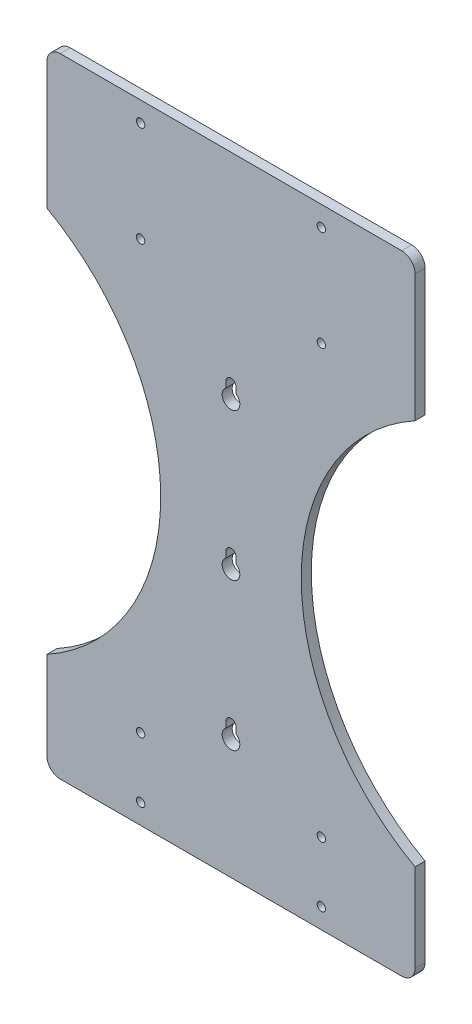
ISO-10303-21;
HEADER;
FILE_DESCRIPTION(('STEP AP214'),'2;1');
FILE_NAME('part.step','',(''),(''),'','','');
FILE_SCHEMA(('AUTOMOTIVE_DESIGN { 1 0 10303 214 1 1 1 1 }'));
ENDSEC;
DATA;
#1=APPLICATION_CONTEXT('core data for automotive mechanical design processes');
#2=APPLICATION_PROTOCOL_DEFINITION('international standard','automotive_design',2000,#1);
#3=PRODUCT_CONTEXT('',#1,'mechanical');
#4=PRODUCT('Part','Part','',(#3));
#5=PRODUCT_RELATED_PRODUCT_CATEGORY('part','',(#4));
#6=PRODUCT_DEFINITION_FORMATION('','',#4);
#7=PRODUCT_DEFINITION_CONTEXT('part definition',#1,'design');
#8=PRODUCT_DEFINITION('design','',#6,#7);
#9=PRODUCT_DEFINITION_SHAPE('','',#8);
#10=(LENGTH_UNIT() NAMED_UNIT(*) SI_UNIT(.MILLI.,.METRE.));
#11=(NAMED_UNIT(*) PLANE_ANGLE_UNIT() SI_UNIT($,.RADIAN.));
#12=(NAMED_UNIT(*) SI_UNIT($,.STERADIAN.) SOLID_ANGLE_UNIT());
#13=UNCERTAINTY_MEASURE_WITH_UNIT(LENGTH_MEASURE(1.E-05),#10,'distance_accuracy_value','');
#14=(GEOMETRIC_REPRESENTATION_CONTEXT(3) GLOBAL_UNCERTAINTY_ASSIGNED_CONTEXT((#13)) GLOBAL_UNIT_ASSIGNED_CONTEXT((#10,
#11,#12)) REPRESENTATION_CONTEXT('',''));
#15=CARTESIAN_POINT('',(0.,0.,0.));
#16=DIRECTION('',(0.,0.,1.));
#17=DIRECTION('',(1.,0.,0.));
#18=AXIS2_PLACEMENT_3D('',#15,#16,#17);
#19=CARTESIAN_POINT('',(-276.225,-31.7500000000001,0.));
#20=DIRECTION('',(0.,0.,1.));
#21=DIRECTION('',(1.,0.,0.));
#22=AXIS2_PLACEMENT_3D('',#19,#20,#21);
#23=PLANE('',#22);
#24=CARTESIAN_POINT('',(85.7249999999999,265.938,0.));
#25=DIRECTION('',(0.,0.,-1.));
#26=DIRECTION('',(-1.,0.,0.));
#27=AXIS2_PLACEMENT_3D('',#24,#25,#26);
#28=CIRCLE('',#27,3.96874999999999);
#29=CARTESIAN_POINT('',(81.75625,265.938,0.));
#30=VERTEX_POINT('',#29);
#31=EDGE_CURVE('E604',#30,#30,#28,.T.);
#32=ORIENTED_EDGE('',*,*,#31,.F.);
#33=EDGE_LOOP('',(#32));
#34=FACE_BOUND('',#33,.T.);
#35=CARTESIAN_POINT('',(-85.725,170.688,0.));
#36=DIRECTION('',(0.,0.,-1.));
#37=DIRECTION('',(-1.,0.,0.));
#38=AXIS2_PLACEMENT_3D('',#35,#36,#37);
#39=CIRCLE('',#38,3.96874999999999);
#40=CARTESIAN_POINT('',(-89.69375,170.688,0.));
#41=VERTEX_POINT('',#40);
#42=EDGE_CURVE('E612',#41,#41,#39,.T.);
#43=ORIENTED_EDGE('',*,*,#42,.F.);
#44=EDGE_LOOP('',(#43));
#45=FACE_BOUND('',#44,.T.);
#46=CARTESIAN_POINT('',(-85.7249999999999,265.938,0.));
#47=DIRECTION('',(0.,0.,-1.));
#48=DIRECTION('',(-1.,0.,0.));
#49=AXIS2_PLACEMENT_3D('',#46,#47,#48);
#50=CIRCLE('',#49,3.96874999999999);
#51=CARTESIAN_POINT('',(-89.6937499999999,265.938,0.));
#52=VERTEX_POINT('',#51);
#53=EDGE_CURVE('E618',#52,#52,#50,.T.);
#54=ORIENTED_EDGE('',*,*,#53,.F.);
#55=EDGE_LOOP('',(#54));
#56=FACE_BOUND('',#55,.T.);
#57=CARTESIAN_POINT('',(85.7249999999999,170.688,0.));
#58=DIRECTION('',(0.,0.,-1.));
#59=DIRECTION('',(-1.,0.,0.));
#60=AXIS2_PLACEMENT_3D('',#57,#58,#59);
#61=CIRCLE('',#60,3.96874999999999);
#62=CARTESIAN_POINT('',(81.75625,170.688,0.));
#63=VERTEX_POINT('',#62);
#64=EDGE_CURVE('E624',#63,#63,#61,.T.);
#65=ORIENTED_EDGE('',*,*,#64,.F.);
#66=EDGE_LOOP('',(#65));
#67=FACE_BOUND('',#66,.T.);
#68=CARTESIAN_POINT('',(-85.725,-234.95,0.));
#69=DIRECTION('',(0.,0.,-1.));
#70=DIRECTION('',(-1.,0.,0.));
#71=AXIS2_PLACEMENT_3D('',#68,#69,#70);
#72=CIRCLE('',#71,3.96874999999999);
#73=CARTESIAN_POINT('',(-89.69375,-234.95,0.));
#74=VERTEX_POINT('',#73);
#75=EDGE_CURVE('E630',#74,#74,#72,.T.);
#76=ORIENTED_EDGE('',*,*,#75,.F.);
#77=EDGE_LOOP('',(#76));
#78=FACE_BOUND('',#77,.T.);
#79=CARTESIAN_POINT('',(-85.725,-292.1,0.));
#80=DIRECTION('',(0.,0.,-1.));
#81=DIRECTION('',(-1.,0.,0.));
#82=AXIS2_PLACEMENT_3D('',#79,#80,#81);
#83=CIRCLE('',#82,3.96874999999999);
#84=CARTESIAN_POINT('',(-89.69375,-292.1,0.));
#85=VERTEX_POINT('',#84);
#86=EDGE_CURVE('E636',#85,#85,#83,.T.);
#87=ORIENTED_EDGE('',*,*,#86,.F.);
#88=EDGE_LOOP('',(#87));
#89=FACE_BOUND('',#88,.T.);
#90=CARTESIAN_POINT('',(85.7249999999999,-292.1,0.));
#91=DIRECTION('',(0.,0.,-1.));
#92=DIRECTION('',(-1.,0.,0.));
#93=AXIS2_PLACEMENT_3D('',#90,#91,#92);
#94=CIRCLE('',#93,3.96874999999999);
#95=CARTESIAN_POINT('',(81.7562499999999,-292.1,0.));
#96=VERTEX_POINT('',#95);
#97=EDGE_CURVE('E642',#96,#96,#94,.T.);
#98=ORIENTED_EDGE('',*,*,#97,.F.);
#99=EDGE_LOOP('',(#98));
#100=FACE_BOUND('',#99,.T.);
#101=CARTESIAN_POINT('',(85.7249999999999,-234.95,0.));
#102=DIRECTION('',(0.,0.,-1.));
#103=DIRECTION('',(-1.,0.,0.));
#104=AXIS2_PLACEMENT_3D('',#101,#102,#103);
#105=CIRCLE('',#104,3.96874999999999);
#106=CARTESIAN_POINT('',(81.7562499999999,-234.95,0.));
#107=VERTEX_POINT('',#106);
#108=EDGE_CURVE('E648',#107,#107,#105,.T.);
#109=ORIENTED_EDGE('',*,*,#108,.F.);
#110=EDGE_LOOP('',(#109));
#111=FACE_BOUND('',#110,.T.);
#112=DIRECTION('',(0.,-1.,0.));
#113=VECTOR('',#112,1.);
#114=CARTESIAN_POINT('',(-174.625,151.522045058705,0.));
#115=LINE('',#114,#113);
#116=CARTESIAN_POINT('',(-174.625,272.172045058705,0.));
#117=VERTEX_POINT('',#116);
#118=CARTESIAN_POINT('',(-174.625,151.522045058705,0.));
#119=VERTEX_POINT('',#118);
#120=EDGE_CURVE('E521',#117,#119,#115,.T.);
#121=ORIENTED_EDGE('',*,*,#120,.F.);
#122=CARTESIAN_POINT('',(-161.925,272.172045058705,0.));
#123=DIRECTION('',(0.,0.,1.));
#124=DIRECTION('',(1.,0.,0.));
#125=AXIS2_PLACEMENT_3D('',#122,#123,#124);
#126=CIRCLE('',#125,12.7);
#127=CARTESIAN_POINT('',(-161.925,284.872045058705,0.));
#128=VERTEX_POINT('',#127);
#129=EDGE_CURVE('E576',#117,#128,#126,.F.);
#130=ORIENTED_EDGE('',*,*,#129,.T.);
#131=DIRECTION('',(-1.,0.,0.));
#132=VECTOR('',#131,1.);
#133=CARTESIAN_POINT('',(174.625,284.872045058705,0.));
#134=LINE('',#133,#132);
#135=CARTESIAN_POINT('',(161.925,284.872045058705,0.));
#136=VERTEX_POINT('',#135);
#137=EDGE_CURVE('E599',#136,#128,#134,.T.);
#138=ORIENTED_EDGE('',*,*,#137,.F.);
#139=CARTESIAN_POINT('',(161.925,272.172045058705,0.));
#140=DIRECTION('',(0.,0.,1.));
#141=DIRECTION('',(1.,0.,0.));
#142=AXIS2_PLACEMENT_3D('',#139,#140,#141);
#143=CIRCLE('',#142,12.7);
#144=CARTESIAN_POINT('',(174.625,272.172045058705,0.));
#145=VERTEX_POINT('',#144);
#146=EDGE_CURVE('E574',#136,#145,#143,.F.);
#147=ORIENTED_EDGE('',*,*,#146,.T.);
#148=DIRECTION('',(0.,1.,0.));
#149=VECTOR('',#148,1.);
#150=CARTESIAN_POINT('',(174.625,151.522045058705,0.));
#151=LINE('',#150,#149);
#152=CARTESIAN_POINT('',(174.625,151.522045058705,0.));
#153=VERTEX_POINT('',#152);
#154=EDGE_CURVE('E501',#153,#145,#151,.T.);
#155=ORIENTED_EDGE('',*,*,#154,.F.);
#156=CARTESIAN_POINT('',(276.225,-31.7500000000001,0.));
#157=DIRECTION('',(0.,0.,-1.));
#158=DIRECTION('',(-1.,0.,0.));
#159=AXIS2_PLACEMENT_3D('',#156,#157,#158);
#160=CIRCLE('',#159,209.55);
#161=CARTESIAN_POINT('',(174.625,-215.022045058705,0.));
#162=VERTEX_POINT('',#161);
#163=EDGE_CURVE('E505',#162,#153,#160,.T.);
#164=ORIENTED_EDGE('',*,*,#163,.F.);
#165=DIRECTION('',(0.,1.,0.));
#166=VECTOR('',#165,1.);
#167=CARTESIAN_POINT('',(174.625,-311.15,0.));
#168=LINE('',#167,#166);
#169=CARTESIAN_POINT('',(174.625,-298.45,0.));
#170=VERTEX_POINT('',#169);
#171=EDGE_CURVE('E531',#170,#162,#168,.T.);
#172=ORIENTED_EDGE('',*,*,#171,.F.);
#173=CARTESIAN_POINT('',(161.925,-298.45,0.));
#174=DIRECTION('',(0.,0.,1.));
#175=DIRECTION('',(1.,0.,0.));
#176=AXIS2_PLACEMENT_3D('',#173,#174,#175);
#177=CIRCLE('',#176,12.7);
#178=CARTESIAN_POINT('',(161.925,-311.15,0.));
#179=VERTEX_POINT('',#178);
#180=EDGE_CURVE('E550',#170,#179,#177,.F.);
#181=ORIENTED_EDGE('',*,*,#180,.T.);
#182=DIRECTION('',(1.,0.,0.));
#183=VECTOR('',#182,1.);
#184=CARTESIAN_POINT('',(-174.625,-311.15,0.));
#185=LINE('',#184,#183);
#186=CARTESIAN_POINT('',(-161.925,-311.15,0.));
#187=VERTEX_POINT('',#186);
#188=EDGE_CURVE('E528',#187,#179,#185,.T.);
#189=ORIENTED_EDGE('',*,*,#188,.F.);
#190=CARTESIAN_POINT('',(-161.925,-298.45,0.));
#191=DIRECTION('',(0.,0.,1.));
#192=DIRECTION('',(1.,0.,0.));
#193=AXIS2_PLACEMENT_3D('',#190,#191,#192);
#194=CIRCLE('',#193,12.7);
#195=CARTESIAN_POINT('',(-174.625,-298.45,0.));
#196=VERTEX_POINT('',#195);
#197=EDGE_CURVE('E548',#187,#196,#194,.F.);
#198=ORIENTED_EDGE('',*,*,#197,.T.);
#199=DIRECTION('',(0.,-1.,0.));
#200=VECTOR('',#199,1.);
#201=CARTESIAN_POINT('',(-174.625,-311.15,0.));
#202=LINE('',#201,#200);
#203=CARTESIAN_POINT('',(-174.625,-215.022045058705,0.));
#204=VERTEX_POINT('',#203);
#205=EDGE_CURVE('E525',#204,#196,#202,.T.);
#206=ORIENTED_EDGE('',*,*,#205,.F.);
#207=CARTESIAN_POINT('',(-276.225,-31.7500000000001,0.));
#208=DIRECTION('',(0.,0.,-1.));
#209=DIRECTION('',(1.,0.,0.));
#210=AXIS2_PLACEMENT_3D('',#207,#208,#209);
#211=CIRCLE('',#210,209.55);
#212=EDGE_CURVE('E523',#119,#204,#211,.T.);
#213=ORIENTED_EDGE('',*,*,#212,.F.);
#214=EDGE_LOOP('',(#121,#130,#138,#147,#155,#164,#172,#181,#189,#198,#206,#213));
#215=FACE_BOUND('',#214,.T.);
#216=DIRECTION('',(0.,1.,0.));
#217=VECTOR('',#216,1.);
#218=CARTESIAN_POINT('',(-4.78789999999995,-57.8866000000001,0.));
#219=LINE('',#218,#217);
#220=CARTESIAN_POINT('',(-4.78789999999995,-51.0066336054601,0.));
#221=VERTEX_POINT('',#220);
#222=CARTESIAN_POINT('',(-4.78789999999995,-45.2374000000001,0.));
#223=VERTEX_POINT('',#222);
#224=EDGE_CURVE('E485',#221,#223,#219,.T.);
#225=ORIENTED_EDGE('',*,*,#224,.F.);
#226=CARTESIAN_POINT('',(0.,-57.8866000000001,0.));
#227=DIRECTION('',(0.,0.,1.));
#228=DIRECTION('',(1.,0.,0.));
#229=AXIS2_PLACEMENT_3D('',#226,#227,#228);
#230=CIRCLE('',#229,8.382);
#231=CARTESIAN_POINT('',(4.78790000000004,-51.0066336054601,0.));
#232=VERTEX_POINT('',#231);
#233=EDGE_CURVE('E660',#221,#232,#230,.T.);
#234=ORIENTED_EDGE('',*,*,#233,.T.);
#235=DIRECTION('',(0.,1.,0.));
#236=VECTOR('',#235,1.);
#237=CARTESIAN_POINT('',(4.78790000000004,-57.8866000000001,0.));
#238=LINE('',#237,#236);
#239=CARTESIAN_POINT('',(4.78790000000004,-45.2374000000001,0.));
#240=VERTEX_POINT('',#239);
#241=EDGE_CURVE('E483',#232,#240,#238,.T.);
#242=ORIENTED_EDGE('',*,*,#241,.T.);
#243=CARTESIAN_POINT('',(0.,-45.2374000000001,0.));
#244=DIRECTION('',(0.,0.,1.));
#245=DIRECTION('',(1.,0.,0.));
#246=AXIS2_PLACEMENT_3D('',#243,#244,#245);
#247=CIRCLE('',#246,4.7879);
#248=EDGE_CURVE('E495',#240,#223,#247,.T.);
#249=ORIENTED_EDGE('',*,*,#248,.T.);
#250=EDGE_LOOP('',(#225,#234,#242,#249));
#251=FACE_BOUND('',#250,.T.);
#252=DIRECTION('',(0.,1.,0.));
#253=VECTOR('',#252,1.);
#254=CARTESIAN_POINT('',(-4.78789999999997,81.8133999999999,0.));
#255=LINE('',#254,#253);
#256=CARTESIAN_POINT('',(-4.78789999999997,88.6933663945399,0.));
#257=VERTEX_POINT('',#256);
#258=CARTESIAN_POINT('',(-4.78789999999997,94.4625999999999,0.));
#259=VERTEX_POINT('',#258);
#260=EDGE_CURVE('E465',#257,#259,#255,.T.);
#261=ORIENTED_EDGE('',*,*,#260,.F.);
#262=CARTESIAN_POINT('',(0.,81.8133999999999,0.));
#263=DIRECTION('',(0.,0.,1.));
#264=DIRECTION('',(1.,0.,0.));
#265=AXIS2_PLACEMENT_3D('',#262,#263,#264);
#266=CIRCLE('',#265,8.382);
#267=CARTESIAN_POINT('',(4.78790000000003,88.6933663945399,0.));
#268=VERTEX_POINT('',#267);
#269=EDGE_CURVE('E440',#257,#268,#266,.T.);
#270=ORIENTED_EDGE('',*,*,#269,.T.);
#271=DIRECTION('',(0.,1.,0.));
#272=VECTOR('',#271,1.);
#273=CARTESIAN_POINT('',(4.78790000000003,81.8133999999999,0.));
#274=LINE('',#273,#272);
#275=CARTESIAN_POINT('',(4.78790000000002,94.4625999999999,0.));
#276=VERTEX_POINT('',#275);
#277=EDGE_CURVE('E463',#268,#276,#274,.T.);
#278=ORIENTED_EDGE('',*,*,#277,.T.);
#279=CARTESIAN_POINT('',(0.,94.4625999999999,0.));
#280=DIRECTION('',(0.,0.,1.));
#281=DIRECTION('',(1.,0.,0.));
#282=AXIS2_PLACEMENT_3D('',#279,#280,#281);
#283=CIRCLE('',#282,4.7879);
#284=EDGE_CURVE('E475',#276,#259,#283,.T.);
#285=ORIENTED_EDGE('',*,*,#284,.T.);
#286=EDGE_LOOP('',(#261,#270,#278,#285));
#287=FACE_BOUND('',#286,.T.);
#288=DIRECTION('',(0.,1.,0.));
#289=VECTOR('',#288,1.);
#290=CARTESIAN_POINT('',(-4.78789999999993,-197.5866,0.));
#291=LINE('',#290,#289);
#292=CARTESIAN_POINT('',(-4.78789999999994,-190.70663360546,0.));
#293=VERTEX_POINT('',#292);
#294=CARTESIAN_POINT('',(-4.78789999999994,-184.9374,0.));
#295=VERTEX_POINT('',#294);
#296=EDGE_CURVE('E447',#293,#295,#291,.T.);
#297=ORIENTED_EDGE('',*,*,#296,.F.);
#298=CARTESIAN_POINT('',(0.,-197.5866,0.));
#299=DIRECTION('',(0.,0.,1.));
#300=DIRECTION('',(1.,0.,0.));
#301=AXIS2_PLACEMENT_3D('',#298,#299,#300);
#302=CIRCLE('',#301,8.38200000000001);
#303=CARTESIAN_POINT('',(4.78790000000006,-190.70663360546,0.));
#304=VERTEX_POINT('',#303);
#305=EDGE_CURVE('E426',#293,#304,#302,.T.);
#306=ORIENTED_EDGE('',*,*,#305,.T.);
#307=DIRECTION('',(0.,1.,0.));
#308=VECTOR('',#307,1.);
#309=CARTESIAN_POINT('',(4.78790000000006,-197.5866,0.));
#310=LINE('',#309,#308);
#311=CARTESIAN_POINT('',(4.78790000000004,-184.9374,0.));
#312=VERTEX_POINT('',#311);
#313=EDGE_CURVE('E452',#304,#312,#310,.T.);
#314=ORIENTED_EDGE('',*,*,#313,.T.);
#315=CARTESIAN_POINT('',(0.,-184.9374,0.));
#316=DIRECTION('',(0.,0.,1.));
#317=DIRECTION('',(1.,0.,0.));
#318=AXIS2_PLACEMENT_3D('',#315,#316,#317);
#319=CIRCLE('',#318,4.7879);
#320=EDGE_CURVE('E457',#312,#295,#319,.T.);
#321=ORIENTED_EDGE('',*,*,#320,.T.);
#322=EDGE_LOOP('',(#297,#306,#314,#321));
#323=FACE_BOUND('',#322,.T.);
#324=ADVANCED_FACE('F258',(#34,#45,#56,#67,#78,#89,#100,#111,#215,#251,#287,#323),#23,.F.);
#325=CARTESIAN_POINT('',(174.625,151.522045058705,9.525));
#326=DIRECTION('',(-1.,0.,0.));
#327=DIRECTION('',(0.,0.,1.));
#328=AXIS2_PLACEMENT_3D('',#325,#326,#327);
#329=PLANE('',#328);
#330=ORIENTED_EDGE('',*,*,#154,.T.);
#331=DIRECTION('',(0.,0.,-1.));
#332=VECTOR('',#331,1.);
#333=CARTESIAN_POINT('',(174.625,272.172045058705,9.525));
#334=LINE('',#333,#332);
#335=CARTESIAN_POINT('',(174.625,272.172045058705,9.525));
#336=VERTEX_POINT('',#335);
#337=EDGE_CURVE('E13',#145,#336,#334,.F.);
#338=ORIENTED_EDGE('',*,*,#337,.T.);
#339=DIRECTION('',(0.,1.,0.));
#340=VECTOR('',#339,1.);
#341=CARTESIAN_POINT('',(174.625,151.522045058705,9.525));
#342=LINE('',#341,#340);
#343=CARTESIAN_POINT('',(174.625,151.522045058705,9.525));
#344=VERTEX_POINT('',#343);
#345=EDGE_CURVE('E502',#344,#336,#342,.T.);
#346=ORIENTED_EDGE('',*,*,#345,.F.);
#347=DIRECTION('',(0.,0.,-1.));
#348=VECTOR('',#347,1.);
#349=CARTESIAN_POINT('',(174.625,151.522045058705,9.525));
#350=LINE('',#349,#348);
#351=EDGE_CURVE('E519',#344,#153,#350,.T.);
#352=ORIENTED_EDGE('',*,*,#351,.T.);
#353=EDGE_LOOP('',(#330,#338,#346,#352));
#354=FACE_BOUND('',#353,.T.);
#355=ADVANCED_FACE('F689',(#354),#329,.F.);
#356=CARTESIAN_POINT('',(-174.625,151.522045058705,9.525));
#357=DIRECTION('',(1.,0.,0.));
#358=DIRECTION('',(0.,0.,-1.));
#359=AXIS2_PLACEMENT_3D('',#356,#357,#358);
#360=PLANE('',#359);
#361=DIRECTION('',(0.,-1.,0.));
#362=VECTOR('',#361,1.);
#363=CARTESIAN_POINT('',(-174.625,151.522045058705,9.525));
#364=LINE('',#363,#362);
#365=CARTESIAN_POINT('',(-174.625,272.172045058705,9.525));
#366=VERTEX_POINT('',#365);
#367=CARTESIAN_POINT('',(-174.625,151.522045058705,9.525));
#368=VERTEX_POINT('',#367);
#369=EDGE_CURVE('E504',#366,#368,#364,.T.);
#370=ORIENTED_EDGE('',*,*,#369,.F.);
#371=DIRECTION('',(0.,0.,-1.));
#372=VECTOR('',#371,1.);
#373=CARTESIAN_POINT('',(-174.625,272.172045058705,9.525));
#374=LINE('',#373,#372);
#375=EDGE_CURVE('E571',#366,#117,#374,.T.);
#376=ORIENTED_EDGE('',*,*,#375,.T.);
#377=ORIENTED_EDGE('',*,*,#120,.T.);
#378=DIRECTION('',(0.,0.,-1.));
#379=VECTOR('',#378,1.);
#380=CARTESIAN_POINT('',(-174.625,151.522045058705,9.525));
#381=LINE('',#380,#379);
#382=EDGE_CURVE('E542',#368,#119,#381,.T.);
#383=ORIENTED_EDGE('',*,*,#382,.F.);
#384=EDGE_LOOP('',(#370,#376,#377,#383));
#385=FACE_BOUND('',#384,.T.);
#386=ADVANCED_FACE('F592',(#385),#360,.F.);
#387=CARTESIAN_POINT('',(-276.225,-31.7500000000001,9.525));
#388=DIRECTION('',(0.,0.,-1.));
#389=DIRECTION('',(-1.,0.,0.));
#390=AXIS2_PLACEMENT_3D('',#387,#388,#389);
#391=CYLINDRICAL_SURFACE('',#390,209.55);
#392=ORIENTED_EDGE('',*,*,#212,.T.);
#393=DIRECTION('',(0.,0.,-1.));
#394=VECTOR('',#393,1.);
#395=CARTESIAN_POINT('',(-174.625,-215.022045058705,9.525));
#396=LINE('',#395,#394);
#397=CARTESIAN_POINT('',(-174.625,-215.022045058705,9.525));
#398=VERTEX_POINT('',#397);
#399=EDGE_CURVE('E539',#398,#204,#396,.T.);
#400=ORIENTED_EDGE('',*,*,#399,.F.);
#401=CARTESIAN_POINT('',(-276.225,-31.7500000000001,9.525));
#402=DIRECTION('',(0.,0.,-1.));
#403=DIRECTION('',(1.,0.,0.));
#404=AXIS2_PLACEMENT_3D('',#401,#402,#403);
#405=CIRCLE('',#404,209.55);
#406=EDGE_CURVE('E507',#368,#398,#405,.T.);
#407=ORIENTED_EDGE('',*,*,#406,.F.);
#408=ORIENTED_EDGE('',*,*,#382,.T.);
#409=EDGE_LOOP('',(#392,#400,#407,#408));
#410=FACE_BOUND('',#409,.T.);
#411=ADVANCED_FACE('F716',(#410),#391,.F.);
#412=CARTESIAN_POINT('',(-174.625,-311.15,9.525));
#413=DIRECTION('',(1.,0.,0.));
#414=DIRECTION('',(0.,0.,-1.));
#415=AXIS2_PLACEMENT_3D('',#412,#413,#414);
#416=PLANE('',#415);
#417=ORIENTED_EDGE('',*,*,#205,.T.);
#418=DIRECTION('',(0.,0.,-1.));
#419=VECTOR('',#418,1.);
#420=CARTESIAN_POINT('',(-174.625,-298.45,9.525));
#421=LINE('',#420,#419);
#422=CARTESIAN_POINT('',(-174.625,-298.45,9.525));
#423=VERTEX_POINT('',#422);
#424=EDGE_CURVE('E561',#196,#423,#421,.F.);
#425=ORIENTED_EDGE('',*,*,#424,.T.);
#426=DIRECTION('',(0.,-1.,0.));
#427=VECTOR('',#426,1.);
#428=CARTESIAN_POINT('',(-174.625,-311.15,9.525));
#429=LINE('',#428,#427);
#430=EDGE_CURVE('E509',#398,#423,#429,.T.);
#431=ORIENTED_EDGE('',*,*,#430,.F.);
#432=ORIENTED_EDGE('',*,*,#399,.T.);
#433=EDGE_LOOP('',(#417,#425,#431,#432));
#434=FACE_BOUND('',#433,.T.);
#435=ADVANCED_FACE('F712',(#434),#416,.F.);
#436=CARTESIAN_POINT('',(-174.625,-311.15,9.525));
#437=DIRECTION('',(0.,1.,0.));
#438=DIRECTION('',(0.,0.,1.));
#439=AXIS2_PLACEMENT_3D('',#436,#437,#438);
#440=PLANE('',#439);
#441=ORIENTED_EDGE('',*,*,#188,.T.);
#442=DIRECTION('',(0.,0.,-1.));
#443=VECTOR('',#442,1.);
#444=CARTESIAN_POINT('',(161.925,-311.15,9.525));
#445=LINE('',#444,#443);
#446=CARTESIAN_POINT('',(161.925,-311.15,9.525));
#447=VERTEX_POINT('',#446);
#448=EDGE_CURVE('E555',#179,#447,#445,.F.);
#449=ORIENTED_EDGE('',*,*,#448,.T.);
#450=DIRECTION('',(1.,0.,0.));
#451=VECTOR('',#450,1.);
#452=CARTESIAN_POINT('',(-174.625,-311.15,9.525));
#453=LINE('',#452,#451);
#454=CARTESIAN_POINT('',(-161.925,-311.15,9.525));
#455=VERTEX_POINT('',#454);
#456=EDGE_CURVE('E512',#455,#447,#453,.T.);
#457=ORIENTED_EDGE('',*,*,#456,.F.);
#458=DIRECTION('',(0.,0.,-1.));
#459=VECTOR('',#458,1.);
#460=CARTESIAN_POINT('',(-161.925,-311.15,9.525));
#461=LINE('',#460,#459);
#462=EDGE_CURVE('E552',#455,#187,#461,.T.);
#463=ORIENTED_EDGE('',*,*,#462,.T.);
#464=EDGE_LOOP('',(#441,#449,#457,#463));
#465=FACE_BOUND('',#464,.T.);
#466=ADVANCED_FACE('F708',(#465),#440,.F.);
#467=CARTESIAN_POINT('',(174.625,-311.15,9.525));
#468=DIRECTION('',(-1.,0.,0.));
#469=DIRECTION('',(0.,0.,1.));
#470=AXIS2_PLACEMENT_3D('',#467,#468,#469);
#471=PLANE('',#470);
#472=DIRECTION('',(0.,1.,0.));
#473=VECTOR('',#472,1.);
#474=CARTESIAN_POINT('',(174.625,-311.15,9.525));
#475=LINE('',#474,#473);
#476=CARTESIAN_POINT('',(174.625,-298.45,9.525));
#477=VERTEX_POINT('',#476);
#478=CARTESIAN_POINT('',(174.625,-215.022045058705,9.525));
#479=VERTEX_POINT('',#478);
#480=EDGE_CURVE('E515',#477,#479,#475,.T.);
#481=ORIENTED_EDGE('',*,*,#480,.F.);
#482=DIRECTION('',(0.,0.,-1.));
#483=VECTOR('',#482,1.);
#484=CARTESIAN_POINT('',(174.625,-298.45,9.525));
#485=LINE('',#484,#483);
#486=EDGE_CURVE('E545',#477,#170,#485,.T.);
#487=ORIENTED_EDGE('',*,*,#486,.T.);
#488=ORIENTED_EDGE('',*,*,#171,.T.);
#489=DIRECTION('',(0.,0.,-1.));
#490=VECTOR('',#489,1.);
#491=CARTESIAN_POINT('',(174.625,-215.022045058705,9.525));
#492=LINE('',#491,#490);
#493=EDGE_CURVE('E536',#479,#162,#492,.T.);
#494=ORIENTED_EDGE('',*,*,#493,.F.);
#495=EDGE_LOOP('',(#481,#487,#488,#494));
#496=FACE_BOUND('',#495,.T.);
#497=ADVANCED_FACE('F704',(#496),#471,.F.);
#498=CARTESIAN_POINT('',(276.225,-31.7500000000001,9.525));
#499=DIRECTION('',(0.,0.,-1.));
#500=DIRECTION('',(-1.,0.,0.));
#501=AXIS2_PLACEMENT_3D('',#498,#499,#500);
#502=CYLINDRICAL_SURFACE('',#501,209.55);
#503=ORIENTED_EDGE('',*,*,#163,.T.);
#504=ORIENTED_EDGE('',*,*,#351,.F.);
#505=CARTESIAN_POINT('',(276.225,-31.7500000000001,9.525));
#506=DIRECTION('',(0.,0.,-1.));
#507=DIRECTION('',(-1.,0.,0.));
#508=AXIS2_PLACEMENT_3D('',#505,#506,#507);
#509=CIRCLE('',#508,209.55);
#510=EDGE_CURVE('E517',#479,#344,#509,.T.);
#511=ORIENTED_EDGE('',*,*,#510,.F.);
#512=ORIENTED_EDGE('',*,*,#493,.T.);
#513=EDGE_LOOP('',(#503,#504,#511,#512));
#514=FACE_BOUND('',#513,.T.);
#515=ADVANCED_FACE('F701',(#514),#502,.F.);
#516=CARTESIAN_POINT('',(-276.225,-31.7500000000001,9.525));
#517=DIRECTION('',(0.,0.,1.));
#518=DIRECTION('',(1.,0.,0.));
#519=AXIS2_PLACEMENT_3D('',#516,#517,#518);
#520=PLANE('',#519);
#521=DIRECTION('',(-1.,0.,0.));
#522=VECTOR('',#521,1.);
#523=CARTESIAN_POINT('',(174.625,284.872045058705,9.525));
#524=LINE('',#523,#522);
#525=CARTESIAN_POINT('',(161.925,284.872045058705,9.525));
#526=VERTEX_POINT('',#525);
#527=CARTESIAN_POINT('',(-161.925,284.872045058705,9.525));
#528=VERTEX_POINT('',#527);
#529=EDGE_CURVE('E588',#526,#528,#524,.T.);
#530=ORIENTED_EDGE('',*,*,#529,.T.);
#531=CARTESIAN_POINT('',(-161.925,272.172045058705,9.525));
#532=DIRECTION('',(0.,0.,1.));
#533=DIRECTION('',(1.,0.,0.));
#534=AXIS2_PLACEMENT_3D('',#531,#532,#533);
#535=CIRCLE('',#534,12.7);
#536=EDGE_CURVE('E266',#528,#366,#535,.T.);
#537=ORIENTED_EDGE('',*,*,#536,.T.);
#538=ORIENTED_EDGE('',*,*,#369,.T.);
#539=ORIENTED_EDGE('',*,*,#406,.T.);
#540=ORIENTED_EDGE('',*,*,#430,.T.);
#541=CARTESIAN_POINT('',(-161.925,-298.45,9.525));
#542=DIRECTION('',(0.,0.,1.));
#543=DIRECTION('',(1.,0.,0.));
#544=AXIS2_PLACEMENT_3D('',#541,#542,#543);
#545=CIRCLE('',#544,12.7);
#546=EDGE_CURVE('E557',#423,#455,#545,.T.);
#547=ORIENTED_EDGE('',*,*,#546,.T.);
#548=ORIENTED_EDGE('',*,*,#456,.T.);
#549=CARTESIAN_POINT('',(161.925,-298.45,9.525));
#550=DIRECTION('',(0.,0.,1.));
#551=DIRECTION('',(1.,0.,0.));
#552=AXIS2_PLACEMENT_3D('',#549,#550,#551);
#553=CIRCLE('',#552,12.7);
#554=EDGE_CURVE('E559',#447,#477,#553,.T.);
#555=ORIENTED_EDGE('',*,*,#554,.T.);
#556=ORIENTED_EDGE('',*,*,#480,.T.);
#557=ORIENTED_EDGE('',*,*,#510,.T.);
#558=ORIENTED_EDGE('',*,*,#345,.T.);
#559=CARTESIAN_POINT('',(161.925,272.172045058705,9.525));
#560=DIRECTION('',(0.,0.,1.));
#561=DIRECTION('',(1.,0.,0.));
#562=AXIS2_PLACEMENT_3D('',#559,#560,#561);
#563=CIRCLE('',#562,12.7);
#564=EDGE_CURVE('E582',#336,#526,#563,.T.);
#565=ORIENTED_EDGE('',*,*,#564,.T.);
#566=EDGE_LOOP('',(#530,#537,#538,#539,#540,#547,#548,#555,#556,#557,#558,#565));
#567=FACE_BOUND('',#566,.T.);
#568=CARTESIAN_POINT('',(85.7249999999999,265.938,9.525));
#569=DIRECTION('',(0.,0.,-1.));
#570=DIRECTION('',(-1.,0.,0.));
#571=AXIS2_PLACEMENT_3D('',#568,#569,#570);
#572=CIRCLE('',#571,3.96874999999999);
#573=CARTESIAN_POINT('',(81.75625,265.938,9.525));
#574=VERTEX_POINT('',#573);
#575=EDGE_CURVE('E609',#574,#574,#572,.T.);
#576=ORIENTED_EDGE('',*,*,#575,.T.);
#577=EDGE_LOOP('',(#576));
#578=FACE_BOUND('',#577,.T.);
#579=CARTESIAN_POINT('',(-85.725,170.688,9.525));
#580=DIRECTION('',(0.,0.,-1.));
#581=DIRECTION('',(-1.,0.,0.));
#582=AXIS2_PLACEMENT_3D('',#579,#580,#581);
#583=CIRCLE('',#582,3.96874999999999);
#584=CARTESIAN_POINT('',(-89.69375,170.688,9.525));
#585=VERTEX_POINT('',#584);
#586=EDGE_CURVE('E615',#585,#585,#583,.T.);
#587=ORIENTED_EDGE('',*,*,#586,.T.);
#588=EDGE_LOOP('',(#587));
#589=FACE_BOUND('',#588,.T.);
#590=CARTESIAN_POINT('',(-85.7249999999999,265.938,9.525));
#591=DIRECTION('',(0.,0.,-1.));
#592=DIRECTION('',(-1.,0.,0.));
#593=AXIS2_PLACEMENT_3D('',#590,#591,#592);
#594=CIRCLE('',#593,3.96874999999999);
#595=CARTESIAN_POINT('',(-89.6937499999999,265.938,9.525));
#596=VERTEX_POINT('',#595);
#597=EDGE_CURVE('E621',#596,#596,#594,.T.);
#598=ORIENTED_EDGE('',*,*,#597,.T.);
#599=EDGE_LOOP('',(#598));
#600=FACE_BOUND('',#599,.T.);
#601=CARTESIAN_POINT('',(85.7249999999999,170.688,9.525));
#602=DIRECTION('',(0.,0.,-1.));
#603=DIRECTION('',(-1.,0.,0.));
#604=AXIS2_PLACEMENT_3D('',#601,#602,#603);
#605=CIRCLE('',#604,3.96874999999999);
#606=CARTESIAN_POINT('',(81.75625,170.688,9.525));
#607=VERTEX_POINT('',#606);
#608=EDGE_CURVE('E627',#607,#607,#605,.T.);
#609=ORIENTED_EDGE('',*,*,#608,.T.);
#610=EDGE_LOOP('',(#609));
#611=FACE_BOUND('',#610,.T.);
#612=CARTESIAN_POINT('',(-85.725,-234.95,9.525));
#613=DIRECTION('',(0.,0.,-1.));
#614=DIRECTION('',(-1.,0.,0.));
#615=AXIS2_PLACEMENT_3D('',#612,#613,#614);
#616=CIRCLE('',#615,3.96874999999999);
#617=CARTESIAN_POINT('',(-89.69375,-234.95,9.525));
#618=VERTEX_POINT('',#617);
#619=EDGE_CURVE('E633',#618,#618,#616,.T.);
#620=ORIENTED_EDGE('',*,*,#619,.T.);
#621=EDGE_LOOP('',(#620));
#622=FACE_BOUND('',#621,.T.);
#623=CARTESIAN_POINT('',(-85.725,-292.1,9.525));
#624=DIRECTION('',(0.,0.,-1.));
#625=DIRECTION('',(-1.,0.,0.));
#626=AXIS2_PLACEMENT_3D('',#623,#624,#625);
#627=CIRCLE('',#626,3.96874999999999);
#628=CARTESIAN_POINT('',(-89.69375,-292.1,9.525));
#629=VERTEX_POINT('',#628);
#630=EDGE_CURVE('E639',#629,#629,#627,.T.);
#631=ORIENTED_EDGE('',*,*,#630,.T.);
#632=EDGE_LOOP('',(#631));
#633=FACE_BOUND('',#632,.T.);
#634=CARTESIAN_POINT('',(85.7249999999999,-292.1,9.525));
#635=DIRECTION('',(0.,0.,-1.));
#636=DIRECTION('',(-1.,0.,0.));
#637=AXIS2_PLACEMENT_3D('',#634,#635,#636);
#638=CIRCLE('',#637,3.96874999999999);
#639=CARTESIAN_POINT('',(81.7562499999999,-292.1,9.525));
#640=VERTEX_POINT('',#639);
#641=EDGE_CURVE('E645',#640,#640,#638,.T.);
#642=ORIENTED_EDGE('',*,*,#641,.T.);
#643=EDGE_LOOP('',(#642));
#644=FACE_BOUND('',#643,.T.);
#645=CARTESIAN_POINT('',(85.7249999999999,-234.95,9.525));
#646=DIRECTION('',(0.,0.,-1.));
#647=DIRECTION('',(-1.,0.,0.));
#648=AXIS2_PLACEMENT_3D('',#645,#646,#647);
#649=CIRCLE('',#648,3.96874999999999);
#650=CARTESIAN_POINT('',(81.7562499999999,-234.95,9.525));
#651=VERTEX_POINT('',#650);
#652=EDGE_CURVE('E651',#651,#651,#649,.T.);
#653=ORIENTED_EDGE('',*,*,#652,.T.);
#654=EDGE_LOOP('',(#653));
#655=FACE_BOUND('',#654,.T.);
#656=CARTESIAN_POINT('',(0.,-197.5866,9.525));
#657=DIRECTION('',(0.,0.,1.));
#658=DIRECTION('',(1.,0.,0.));
#659=AXIS2_PLACEMENT_3D('',#656,#657,#658);
#660=CIRCLE('',#659,8.38200000000001);
#661=CARTESIAN_POINT('',(-4.78789999999994,-190.70663360546,9.525));
#662=VERTEX_POINT('',#661);
#663=CARTESIAN_POINT('',(4.78790000000012,-190.70663360546,9.525));
#664=VERTEX_POINT('',#663);
#665=EDGE_CURVE('E423',#662,#664,#660,.T.);
#666=ORIENTED_EDGE('',*,*,#665,.F.);
#667=DIRECTION('',(0.,1.,0.));
#668=VECTOR('',#667,1.);
#669=CARTESIAN_POINT('',(-4.78789999999993,-197.5866,9.525));
#670=LINE('',#669,#668);
#671=CARTESIAN_POINT('',(-4.78789999999994,-184.9374,9.525));
#672=VERTEX_POINT('',#671);
#673=EDGE_CURVE('E437',#662,#672,#670,.T.);
#674=ORIENTED_EDGE('',*,*,#673,.T.);
#675=CARTESIAN_POINT('',(0.,-184.9374,9.525));
#676=DIRECTION('',(0.,0.,1.));
#677=DIRECTION('',(1.,0.,0.));
#678=AXIS2_PLACEMENT_3D('',#675,#676,#677);
#679=CIRCLE('',#678,4.7879);
#680=CARTESIAN_POINT('',(4.78790000000012,-184.9374,9.525));
#681=VERTEX_POINT('',#680);
#682=EDGE_CURVE('E450',#681,#672,#679,.T.);
#683=ORIENTED_EDGE('',*,*,#682,.F.);
#684=DIRECTION('',(0.,1.,0.));
#685=VECTOR('',#684,1.);
#686=CARTESIAN_POINT('',(4.78790000000012,-197.5866,9.525));
#687=LINE('',#686,#685);
#688=EDGE_CURVE('E439',#664,#681,#687,.T.);
#689=ORIENTED_EDGE('',*,*,#688,.F.);
#690=EDGE_LOOP('',(#666,#674,#683,#689));
#691=FACE_BOUND('',#690,.T.);
#692=CARTESIAN_POINT('',(0.,81.8133999999999,9.525));
#693=DIRECTION('',(0.,0.,1.));
#694=DIRECTION('',(1.,0.,0.));
#695=AXIS2_PLACEMENT_3D('',#692,#693,#694);
#696=CIRCLE('',#695,8.382);
#697=CARTESIAN_POINT('',(-4.78789999999997,88.6933663945399,9.525));
#698=VERTEX_POINT('',#697);
#699=CARTESIAN_POINT('',(4.78790000000007,88.6933663945399,9.525));
#700=VERTEX_POINT('',#699);
#701=EDGE_CURVE('E658',#698,#700,#696,.T.);
#702=ORIENTED_EDGE('',*,*,#701,.F.);
#703=DIRECTION('',(0.,1.,0.));
#704=VECTOR('',#703,1.);
#705=CARTESIAN_POINT('',(-4.78789999999997,81.8133999999999,9.525));
#706=LINE('',#705,#704);
#707=CARTESIAN_POINT('',(-4.78789999999997,94.4625999999999,9.525));
#708=VERTEX_POINT('',#707);
#709=EDGE_CURVE('E467',#698,#708,#706,.T.);
#710=ORIENTED_EDGE('',*,*,#709,.T.);
#711=CARTESIAN_POINT('',(0.,94.4625999999999,9.525));
#712=DIRECTION('',(0.,0.,1.));
#713=DIRECTION('',(1.,0.,0.));
#714=AXIS2_PLACEMENT_3D('',#711,#712,#713);
#715=CIRCLE('',#714,4.7879);
#716=CARTESIAN_POINT('',(4.78790000000007,94.4625999999999,9.525));
#717=VERTEX_POINT('',#716);
#718=EDGE_CURVE('E472',#717,#708,#715,.T.);
#719=ORIENTED_EDGE('',*,*,#718,.F.);
#720=DIRECTION('',(0.,1.,0.));
#721=VECTOR('',#720,1.);
#722=CARTESIAN_POINT('',(4.78790000000007,81.8133999999999,9.525));
#723=LINE('',#722,#721);
#724=EDGE_CURVE('E461',#700,#717,#723,.T.);
#725=ORIENTED_EDGE('',*,*,#724,.F.);
#726=EDGE_LOOP('',(#702,#710,#719,#725));
#727=FACE_BOUND('',#726,.T.);
#728=CARTESIAN_POINT('',(0.,-57.8866000000001,9.525));
#729=DIRECTION('',(0.,0.,1.));
#730=DIRECTION('',(1.,0.,0.));
#731=AXIS2_PLACEMENT_3D('',#728,#729,#730);
#732=CIRCLE('',#731,8.382);
#733=CARTESIAN_POINT('',(-4.78789999999995,-51.0066336054601,9.525));
#734=VERTEX_POINT('',#733);
#735=CARTESIAN_POINT('',(4.78790000000001,-51.0066336054601,9.525));
#736=VERTEX_POINT('',#735);
#737=EDGE_CURVE('E654',#734,#736,#732,.T.);
#738=ORIENTED_EDGE('',*,*,#737,.F.);
#739=DIRECTION('',(0.,1.,0.));
#740=VECTOR('',#739,1.);
#741=CARTESIAN_POINT('',(-4.78789999999995,-57.8866000000001,9.525));
#742=LINE('',#741,#740);
#743=CARTESIAN_POINT('',(-4.78789999999995,-45.2374000000001,9.525));
#744=VERTEX_POINT('',#743);
#745=EDGE_CURVE('E487',#734,#744,#742,.T.);
#746=ORIENTED_EDGE('',*,*,#745,.T.);
#747=CARTESIAN_POINT('',(0.,-45.2374000000001,9.525));
#748=DIRECTION('',(0.,0.,1.));
#749=DIRECTION('',(1.,0.,0.));
#750=AXIS2_PLACEMENT_3D('',#747,#748,#749);
#751=CIRCLE('',#750,4.7879);
#752=CARTESIAN_POINT('',(4.78790000000001,-45.2374000000001,9.525));
#753=VERTEX_POINT('',#752);
#754=EDGE_CURVE('E492',#753,#744,#751,.T.);
#755=ORIENTED_EDGE('',*,*,#754,.F.);
#756=DIRECTION('',(0.,1.,0.));
#757=VECTOR('',#756,1.);
#758=CARTESIAN_POINT('',(4.78790000000001,-57.8866000000001,9.525));
#759=LINE('',#758,#757);
#760=EDGE_CURVE('E481',#736,#753,#759,.T.);
#761=ORIENTED_EDGE('',*,*,#760,.F.);
#762=EDGE_LOOP('',(#738,#746,#755,#761));
#763=FACE_BOUND('',#762,.T.);
#764=ADVANCED_FACE('F434',(#567,#578,#589,#600,#611,#622,#633,#644,#655,#691,#727,#763),#520,.T.);
#765=CARTESIAN_POINT('',(0.,-45.2374000000001,9.525));
#766=DIRECTION('',(0.,0.,1.));
#767=DIRECTION('',(1.,0.,0.));
#768=AXIS2_PLACEMENT_3D('',#765,#766,#767);
#769=CYLINDRICAL_SURFACE('',#768,4.7879);
#770=ORIENTED_EDGE('',*,*,#248,.F.);
#771=DIRECTION('',(0.,0.,-1.));
#772=VECTOR('',#771,1.);
#773=CARTESIAN_POINT('',(4.78790000000004,-45.2374000000001,0.));
#774=LINE('',#773,#772);
#775=EDGE_CURVE('E489',#753,#240,#774,.T.);
#776=ORIENTED_EDGE('',*,*,#775,.F.);
#777=ORIENTED_EDGE('',*,*,#754,.T.);
#778=DIRECTION('',(0.,0.,1.));
#779=VECTOR('',#778,1.);
#780=CARTESIAN_POINT('',(-4.78789999999995,-45.2374000000001,9.525));
#781=LINE('',#780,#779);
#782=EDGE_CURVE('E498',#223,#744,#781,.T.);
#783=ORIENTED_EDGE('',*,*,#782,.F.);
#784=EDGE_LOOP('',(#770,#776,#777,#783));
#785=FACE_BOUND('',#784,.T.);
#786=ADVANCED_FACE('F868',(#785),#769,.F.);
#787=CARTESIAN_POINT('',(-4.78789999999995,-57.8866000000001,9.525));
#788=DIRECTION('',(-1.,0.,0.));
#789=DIRECTION('',(0.,-1.,0.));
#790=AXIS2_PLACEMENT_3D('',#787,#788,#789);
#791=PLANE('',#790);
#792=ORIENTED_EDGE('',*,*,#745,.F.);
#793=DIRECTION('',(0.,0.,1.));
#794=VECTOR('',#793,1.);
#795=CARTESIAN_POINT('',(-4.78789999999995,-51.0066336054601,0.));
#796=LINE('',#795,#794);
#797=EDGE_CURVE('E666',#734,#221,#796,.F.);
#798=ORIENTED_EDGE('',*,*,#797,.T.);
#799=ORIENTED_EDGE('',*,*,#224,.T.);
#800=ORIENTED_EDGE('',*,*,#782,.T.);
#801=EDGE_LOOP('',(#792,#798,#799,#800));
#802=FACE_BOUND('',#801,.T.);
#803=ADVANCED_FACE('F892',(#802),#791,.F.);
#804=CARTESIAN_POINT('',(4.78790000000004,-57.8866000000001,0.));
#805=DIRECTION('',(1.,0.,0.));
#806=DIRECTION('',(0.,1.,0.));
#807=AXIS2_PLACEMENT_3D('',#804,#805,#806);
#808=PLANE('',#807);
#809=ORIENTED_EDGE('',*,*,#241,.F.);
#810=DIRECTION('',(0.,0.,1.));
#811=VECTOR('',#810,1.);
#812=CARTESIAN_POINT('',(4.78790000000004,-51.0066336054601,0.));
#813=LINE('',#812,#811);
#814=EDGE_CURVE('E568',#232,#736,#813,.T.);
#815=ORIENTED_EDGE('',*,*,#814,.T.);
#816=ORIENTED_EDGE('',*,*,#760,.T.);
#817=ORIENTED_EDGE('',*,*,#775,.T.);
#818=EDGE_LOOP('',(#809,#815,#816,#817));
#819=FACE_BOUND('',#818,.T.);
#820=ADVANCED_FACE('F898',(#819),#808,.F.);
#821=CARTESIAN_POINT('',(0.,94.4625999999999,9.525));
#822=DIRECTION('',(0.,0.,1.));
#823=DIRECTION('',(1.,0.,0.));
#824=AXIS2_PLACEMENT_3D('',#821,#822,#823);
#825=CYLINDRICAL_SURFACE('',#824,4.7879);
#826=ORIENTED_EDGE('',*,*,#284,.F.);
#827=DIRECTION('',(0.,0.,-1.));
#828=VECTOR('',#827,1.);
#829=CARTESIAN_POINT('',(4.78790000000002,94.4625999999999,0.));
#830=LINE('',#829,#828);
#831=EDGE_CURVE('E469',#717,#276,#830,.T.);
#832=ORIENTED_EDGE('',*,*,#831,.F.);
#833=ORIENTED_EDGE('',*,*,#718,.T.);
#834=DIRECTION('',(0.,0.,1.));
#835=VECTOR('',#834,1.);
#836=CARTESIAN_POINT('',(-4.78789999999997,94.4625999999999,9.525));
#837=LINE('',#836,#835);
#838=EDGE_CURVE('E478',#259,#708,#837,.T.);
#839=ORIENTED_EDGE('',*,*,#838,.F.);
#840=EDGE_LOOP('',(#826,#832,#833,#839));
#841=FACE_BOUND('',#840,.T.);
#842=ADVANCED_FACE('F906',(#841),#825,.F.);
#843=CARTESIAN_POINT('',(-4.78789999999997,81.8133999999999,9.525));
#844=DIRECTION('',(-1.,0.,0.));
#845=DIRECTION('',(0.,-1.,0.));
#846=AXIS2_PLACEMENT_3D('',#843,#844,#845);
#847=PLANE('',#846);
#848=ORIENTED_EDGE('',*,*,#709,.F.);
#849=DIRECTION('',(0.,0.,1.));
#850=VECTOR('',#849,1.);
#851=CARTESIAN_POINT('',(-4.78789999999997,88.6933663945399,0.));
#852=LINE('',#851,#850);
#853=EDGE_CURVE('E430',#698,#257,#852,.F.);
#854=ORIENTED_EDGE('',*,*,#853,.T.);
#855=ORIENTED_EDGE('',*,*,#260,.T.);
#856=ORIENTED_EDGE('',*,*,#838,.T.);
#857=EDGE_LOOP('',(#848,#854,#855,#856));
#858=FACE_BOUND('',#857,.T.);
#859=ADVANCED_FACE('F685',(#858),#847,.F.);
#860=CARTESIAN_POINT('',(4.78790000000003,81.8133999999999,0.));
#861=DIRECTION('',(1.,0.,0.));
#862=DIRECTION('',(0.,1.,0.));
#863=AXIS2_PLACEMENT_3D('',#860,#861,#862);
#864=PLANE('',#863);
#865=ORIENTED_EDGE('',*,*,#277,.F.);
#866=DIRECTION('',(0.,0.,1.));
#867=VECTOR('',#866,1.);
#868=CARTESIAN_POINT('',(4.78790000000002,88.6933663945399,0.));
#869=LINE('',#868,#867);
#870=EDGE_CURVE('E565',#268,#700,#869,.T.);
#871=ORIENTED_EDGE('',*,*,#870,.T.);
#872=ORIENTED_EDGE('',*,*,#724,.T.);
#873=ORIENTED_EDGE('',*,*,#831,.T.);
#874=EDGE_LOOP('',(#865,#871,#872,#873));
#875=FACE_BOUND('',#874,.T.);
#876=ADVANCED_FACE('F678',(#875),#864,.F.);
#877=CARTESIAN_POINT('',(0.,-184.9374,9.525));
#878=DIRECTION('',(0.,0.,1.));
#879=DIRECTION('',(1.,0.,0.));
#880=AXIS2_PLACEMENT_3D('',#877,#878,#879);
#881=CYLINDRICAL_SURFACE('',#880,4.7879);
#882=ORIENTED_EDGE('',*,*,#320,.F.);
#883=DIRECTION('',(0.,0.,-1.));
#884=VECTOR('',#883,1.);
#885=CARTESIAN_POINT('',(4.78790000000006,-184.9374,0.));
#886=LINE('',#885,#884);
#887=EDGE_CURVE('E446',#681,#312,#886,.T.);
#888=ORIENTED_EDGE('',*,*,#887,.F.);
#889=ORIENTED_EDGE('',*,*,#682,.T.);
#890=DIRECTION('',(0.,0.,1.));
#891=VECTOR('',#890,1.);
#892=CARTESIAN_POINT('',(-4.78789999999994,-184.9374,9.525));
#893=LINE('',#892,#891);
#894=EDGE_CURVE('E444',#295,#672,#893,.T.);
#895=ORIENTED_EDGE('',*,*,#894,.F.);
#896=EDGE_LOOP('',(#882,#888,#889,#895));
#897=FACE_BOUND('',#896,.T.);
#898=ADVANCED_FACE('F676',(#897),#881,.F.);
#899=CARTESIAN_POINT('',(-4.78789999999993,-197.5866,9.525));
#900=DIRECTION('',(-1.,0.,0.));
#901=DIRECTION('',(0.,-1.,0.));
#902=AXIS2_PLACEMENT_3D('',#899,#900,#901);
#903=PLANE('',#902);
#904=ORIENTED_EDGE('',*,*,#673,.F.);
#905=DIRECTION('',(0.,0.,1.));
#906=VECTOR('',#905,1.);
#907=CARTESIAN_POINT('',(-4.78789999999993,-190.70663360546,0.));
#908=LINE('',#907,#906);
#909=EDGE_CURVE('E420',#662,#293,#908,.F.);
#910=ORIENTED_EDGE('',*,*,#909,.T.);
#911=ORIENTED_EDGE('',*,*,#296,.T.);
#912=ORIENTED_EDGE('',*,*,#894,.T.);
#913=EDGE_LOOP('',(#904,#910,#911,#912));
#914=FACE_BOUND('',#913,.T.);
#915=ADVANCED_FACE('F442',(#914),#903,.F.);
#916=CARTESIAN_POINT('',(4.78790000000006,-197.5866,0.));
#917=DIRECTION('',(1.,0.,0.));
#918=DIRECTION('',(0.,1.,0.));
#919=AXIS2_PLACEMENT_3D('',#916,#917,#918);
#920=PLANE('',#919);
#921=ORIENTED_EDGE('',*,*,#313,.F.);
#922=DIRECTION('',(0.,0.,1.));
#923=VECTOR('',#922,1.);
#924=CARTESIAN_POINT('',(4.78790000000006,-190.70663360546,0.));
#925=LINE('',#924,#923);
#926=EDGE_CURVE('E563',#304,#664,#925,.T.);
#927=ORIENTED_EDGE('',*,*,#926,.T.);
#928=ORIENTED_EDGE('',*,*,#688,.T.);
#929=ORIENTED_EDGE('',*,*,#887,.T.);
#930=EDGE_LOOP('',(#921,#927,#928,#929));
#931=FACE_BOUND('',#930,.T.);
#932=ADVANCED_FACE('F674',(#931),#920,.F.);
#933=CARTESIAN_POINT('',(161.925,-298.45,9.525));
#934=DIRECTION('',(0.,0.,-1.));
#935=DIRECTION('',(-1.,0.,0.));
#936=AXIS2_PLACEMENT_3D('',#933,#934,#935);
#937=CYLINDRICAL_SURFACE('',#936,12.7);
#938=ORIENTED_EDGE('',*,*,#554,.F.);
#939=ORIENTED_EDGE('',*,*,#448,.F.);
#940=ORIENTED_EDGE('',*,*,#180,.F.);
#941=ORIENTED_EDGE('',*,*,#486,.F.);
#942=EDGE_LOOP('',(#938,#939,#940,#941));
#943=FACE_BOUND('',#942,.T.);
#944=ADVANCED_FACE('F723',(#943),#937,.T.);
#945=CARTESIAN_POINT('',(-161.925,-298.45,9.525));
#946=DIRECTION('',(0.,0.,-1.));
#947=DIRECTION('',(-1.,0.,0.));
#948=AXIS2_PLACEMENT_3D('',#945,#946,#947);
#949=CYLINDRICAL_SURFACE('',#948,12.7);
#950=ORIENTED_EDGE('',*,*,#546,.F.);
#951=ORIENTED_EDGE('',*,*,#424,.F.);
#952=ORIENTED_EDGE('',*,*,#197,.F.);
#953=ORIENTED_EDGE('',*,*,#462,.F.);
#954=EDGE_LOOP('',(#950,#951,#952,#953));
#955=FACE_BOUND('',#954,.T.);
#956=ADVANCED_FACE('F726',(#955),#949,.T.);
#957=CARTESIAN_POINT('',(0.,-197.5866,0.));
#958=DIRECTION('',(0.,0.,1.));
#959=DIRECTION('',(1.,0.,0.));
#960=AXIS2_PLACEMENT_3D('',#957,#958,#959);
#961=CYLINDRICAL_SURFACE('',#960,8.38200000000001);
#962=ORIENTED_EDGE('',*,*,#665,.T.);
#963=ORIENTED_EDGE('',*,*,#926,.F.);
#964=ORIENTED_EDGE('',*,*,#305,.F.);
#965=ORIENTED_EDGE('',*,*,#909,.F.);
#966=EDGE_LOOP('',(#962,#963,#964,#965));
#967=FACE_BOUND('',#966,.T.);
#968=ADVANCED_FACE('F422',(#967),#961,.F.);
#969=CARTESIAN_POINT('',(0.,81.8133999999999,0.));
#970=DIRECTION('',(0.,0.,1.));
#971=DIRECTION('',(1.,0.,0.));
#972=AXIS2_PLACEMENT_3D('',#969,#970,#971);
#973=CYLINDRICAL_SURFACE('',#972,8.382);
#974=ORIENTED_EDGE('',*,*,#701,.T.);
#975=ORIENTED_EDGE('',*,*,#870,.F.);
#976=ORIENTED_EDGE('',*,*,#269,.F.);
#977=ORIENTED_EDGE('',*,*,#853,.F.);
#978=EDGE_LOOP('',(#974,#975,#976,#977));
#979=FACE_BOUND('',#978,.T.);
#980=ADVANCED_FACE('F775',(#979),#973,.F.);
#981=CARTESIAN_POINT('',(0.,-57.8866000000001,0.));
#982=DIRECTION('',(0.,0.,1.));
#983=DIRECTION('',(1.,0.,0.));
#984=AXIS2_PLACEMENT_3D('',#981,#982,#983);
#985=CYLINDRICAL_SURFACE('',#984,8.382);
#986=ORIENTED_EDGE('',*,*,#737,.T.);
#987=ORIENTED_EDGE('',*,*,#814,.F.);
#988=ORIENTED_EDGE('',*,*,#233,.F.);
#989=ORIENTED_EDGE('',*,*,#797,.F.);
#990=EDGE_LOOP('',(#986,#987,#988,#989));
#991=FACE_BOUND('',#990,.T.);
#992=ADVANCED_FACE('F771',(#991),#985,.F.);
#993=CARTESIAN_POINT('',(85.7249999999999,-234.95,0.));
#994=DIRECTION('',(0.,0.,-1.));
#995=DIRECTION('',(-1.,0.,0.));
#996=AXIS2_PLACEMENT_3D('',#993,#994,#995);
#997=CYLINDRICAL_SURFACE('',#996,3.96874999999999);
#998=ORIENTED_EDGE('',*,*,#652,.F.);
#999=EDGE_LOOP('',(#998));
#1000=FACE_BOUND('',#999,.T.);
#1001=ORIENTED_EDGE('',*,*,#108,.T.);
#1002=EDGE_LOOP('',(#1001));
#1003=FACE_BOUND('',#1002,.T.);
#1004=ADVANCED_FACE('F767',(#1000,#1003),#997,.F.);
#1005=CARTESIAN_POINT('',(85.7249999999999,-292.1,0.));
#1006=DIRECTION('',(0.,0.,-1.));
#1007=DIRECTION('',(-1.,0.,0.));
#1008=AXIS2_PLACEMENT_3D('',#1005,#1006,#1007);
#1009=CYLINDRICAL_SURFACE('',#1008,3.96874999999999);
#1010=ORIENTED_EDGE('',*,*,#641,.F.);
#1011=EDGE_LOOP('',(#1010));
#1012=FACE_BOUND('',#1011,.T.);
#1013=ORIENTED_EDGE('',*,*,#97,.T.);
#1014=EDGE_LOOP('',(#1013));
#1015=FACE_BOUND('',#1014,.T.);
#1016=ADVANCED_FACE('F763',(#1012,#1015),#1009,.F.);
#1017=CARTESIAN_POINT('',(-85.725,-292.1,0.));
#1018=DIRECTION('',(0.,0.,-1.));
#1019=DIRECTION('',(-1.,0.,0.));
#1020=AXIS2_PLACEMENT_3D('',#1017,#1018,#1019);
#1021=CYLINDRICAL_SURFACE('',#1020,3.96874999999999);
#1022=ORIENTED_EDGE('',*,*,#630,.F.);
#1023=EDGE_LOOP('',(#1022));
#1024=FACE_BOUND('',#1023,.T.);
#1025=ORIENTED_EDGE('',*,*,#86,.T.);
#1026=EDGE_LOOP('',(#1025));
#1027=FACE_BOUND('',#1026,.T.);
#1028=ADVANCED_FACE('F759',(#1024,#1027),#1021,.F.);
#1029=CARTESIAN_POINT('',(-85.725,-234.95,0.));
#1030=DIRECTION('',(0.,0.,-1.));
#1031=DIRECTION('',(-1.,0.,0.));
#1032=AXIS2_PLACEMENT_3D('',#1029,#1030,#1031);
#1033=CYLINDRICAL_SURFACE('',#1032,3.96874999999999);
#1034=ORIENTED_EDGE('',*,*,#619,.F.);
#1035=EDGE_LOOP('',(#1034));
#1036=FACE_BOUND('',#1035,.T.);
#1037=ORIENTED_EDGE('',*,*,#75,.T.);
#1038=EDGE_LOOP('',(#1037));
#1039=FACE_BOUND('',#1038,.T.);
#1040=ADVANCED_FACE('F755',(#1036,#1039),#1033,.F.);
#1041=CARTESIAN_POINT('',(85.7249999999999,170.688,0.));
#1042=DIRECTION('',(0.,0.,-1.));
#1043=DIRECTION('',(-1.,0.,0.));
#1044=AXIS2_PLACEMENT_3D('',#1041,#1042,#1043);
#1045=CYLINDRICAL_SURFACE('',#1044,3.96874999999999);
#1046=ORIENTED_EDGE('',*,*,#608,.F.);
#1047=EDGE_LOOP('',(#1046));
#1048=FACE_BOUND('',#1047,.T.);
#1049=ORIENTED_EDGE('',*,*,#64,.T.);
#1050=EDGE_LOOP('',(#1049));
#1051=FACE_BOUND('',#1050,.T.);
#1052=ADVANCED_FACE('F751',(#1048,#1051),#1045,.F.);
#1053=CARTESIAN_POINT('',(-85.7249999999999,265.938,0.));
#1054=DIRECTION('',(0.,0.,-1.));
#1055=DIRECTION('',(-1.,0.,0.));
#1056=AXIS2_PLACEMENT_3D('',#1053,#1054,#1055);
#1057=CYLINDRICAL_SURFACE('',#1056,3.96874999999999);
#1058=ORIENTED_EDGE('',*,*,#597,.F.);
#1059=EDGE_LOOP('',(#1058));
#1060=FACE_BOUND('',#1059,.T.);
#1061=ORIENTED_EDGE('',*,*,#53,.T.);
#1062=EDGE_LOOP('',(#1061));
#1063=FACE_BOUND('',#1062,.T.);
#1064=ADVANCED_FACE('F747',(#1060,#1063),#1057,.F.);
#1065=CARTESIAN_POINT('',(-85.725,170.688,0.));
#1066=DIRECTION('',(0.,0.,-1.));
#1067=DIRECTION('',(-1.,0.,0.));
#1068=AXIS2_PLACEMENT_3D('',#1065,#1066,#1067);
#1069=CYLINDRICAL_SURFACE('',#1068,3.96874999999999);
#1070=ORIENTED_EDGE('',*,*,#586,.F.);
#1071=EDGE_LOOP('',(#1070));
#1072=FACE_BOUND('',#1071,.T.);
#1073=ORIENTED_EDGE('',*,*,#42,.T.);
#1074=EDGE_LOOP('',(#1073));
#1075=FACE_BOUND('',#1074,.T.);
#1076=ADVANCED_FACE('F741',(#1072,#1075),#1069,.F.);
#1077=CARTESIAN_POINT('',(85.7249999999999,265.938,0.));
#1078=DIRECTION('',(0.,0.,-1.));
#1079=DIRECTION('',(-1.,0.,0.));
#1080=AXIS2_PLACEMENT_3D('',#1077,#1078,#1079);
#1081=CYLINDRICAL_SURFACE('',#1080,3.96874999999999);
#1082=ORIENTED_EDGE('',*,*,#575,.F.);
#1083=EDGE_LOOP('',(#1082));
#1084=FACE_BOUND('',#1083,.T.);
#1085=ORIENTED_EDGE('',*,*,#31,.T.);
#1086=EDGE_LOOP('',(#1085));
#1087=FACE_BOUND('',#1086,.T.);
#1088=ADVANCED_FACE('F736',(#1084,#1087),#1081,.F.);
#1089=CARTESIAN_POINT('',(174.625,284.872045058705,9.525));
#1090=DIRECTION('',(0.,-1.,0.));
#1091=DIRECTION('',(0.,0.,-1.));
#1092=AXIS2_PLACEMENT_3D('',#1089,#1090,#1091);
#1093=PLANE('',#1092);
#1094=ORIENTED_EDGE('',*,*,#137,.T.);
#1095=DIRECTION('',(0.,0.,-1.));
#1096=VECTOR('',#1095,1.);
#1097=CARTESIAN_POINT('',(-161.925,284.872045058705,9.525));
#1098=LINE('',#1097,#1096);
#1099=EDGE_CURVE('E279',#128,#528,#1098,.F.);
#1100=ORIENTED_EDGE('',*,*,#1099,.T.);
#1101=ORIENTED_EDGE('',*,*,#529,.F.);
#1102=DIRECTION('',(0.,0.,-1.));
#1103=VECTOR('',#1102,1.);
#1104=CARTESIAN_POINT('',(161.925,284.872045058705,9.525));
#1105=LINE('',#1104,#1103);
#1106=EDGE_CURVE('E578',#526,#136,#1105,.T.);
#1107=ORIENTED_EDGE('',*,*,#1106,.T.);
#1108=EDGE_LOOP('',(#1094,#1100,#1101,#1107));
#1109=FACE_BOUND('',#1108,.T.);
#1110=ADVANCED_FACE('F601',(#1109),#1093,.F.);
#1111=CARTESIAN_POINT('',(-161.925,272.172045058705,9.525));
#1112=DIRECTION('',(0.,0.,-1.));
#1113=DIRECTION('',(-1.,0.,0.));
#1114=AXIS2_PLACEMENT_3D('',#1111,#1112,#1113);
#1115=CYLINDRICAL_SURFACE('',#1114,12.7);
#1116=ORIENTED_EDGE('',*,*,#536,.F.);
#1117=ORIENTED_EDGE('',*,*,#1099,.F.);
#1118=ORIENTED_EDGE('',*,*,#129,.F.);
#1119=ORIENTED_EDGE('',*,*,#375,.F.);
#1120=EDGE_LOOP('',(#1116,#1117,#1118,#1119));
#1121=FACE_BOUND('',#1120,.T.);
#1122=ADVANCED_FACE('F595',(#1121),#1115,.T.);
#1123=CARTESIAN_POINT('',(161.925,272.172045058705,9.525));
#1124=DIRECTION('',(0.,0.,-1.));
#1125=DIRECTION('',(-1.,0.,0.));
#1126=AXIS2_PLACEMENT_3D('',#1123,#1124,#1125);
#1127=CYLINDRICAL_SURFACE('',#1126,12.7);
#1128=ORIENTED_EDGE('',*,*,#564,.F.);
#1129=ORIENTED_EDGE('',*,*,#337,.F.);
#1130=ORIENTED_EDGE('',*,*,#146,.F.);
#1131=ORIENTED_EDGE('',*,*,#1106,.F.);
#1132=EDGE_LOOP('',(#1128,#1129,#1130,#1131));
#1133=FACE_BOUND('',#1132,.T.);
#1134=ADVANCED_FACE('F260',(#1133),#1127,.T.);
#1135=CLOSED_SHELL('',(#324,#355,#386,#411,#435,#466,#497,#515,#764,#786,#803,#820,#842,#859,
#876,#898,#915,#932,#944,#956,#968,#980,#992,#1004,#1016,#1028,#1040,#1052,#1064,#1076,#1088,
#1110,#1122,#1134));
#1136=MANIFOLD_SOLID_BREP('B2',#1135);
#1137=ADVANCED_BREP_SHAPE_REPRESENTATION('',(#18,#1136),#14);
#1138=SHAPE_DEFINITION_REPRESENTATION(#9,#1137);
ENDSEC;
END-ISO-10303-21;
